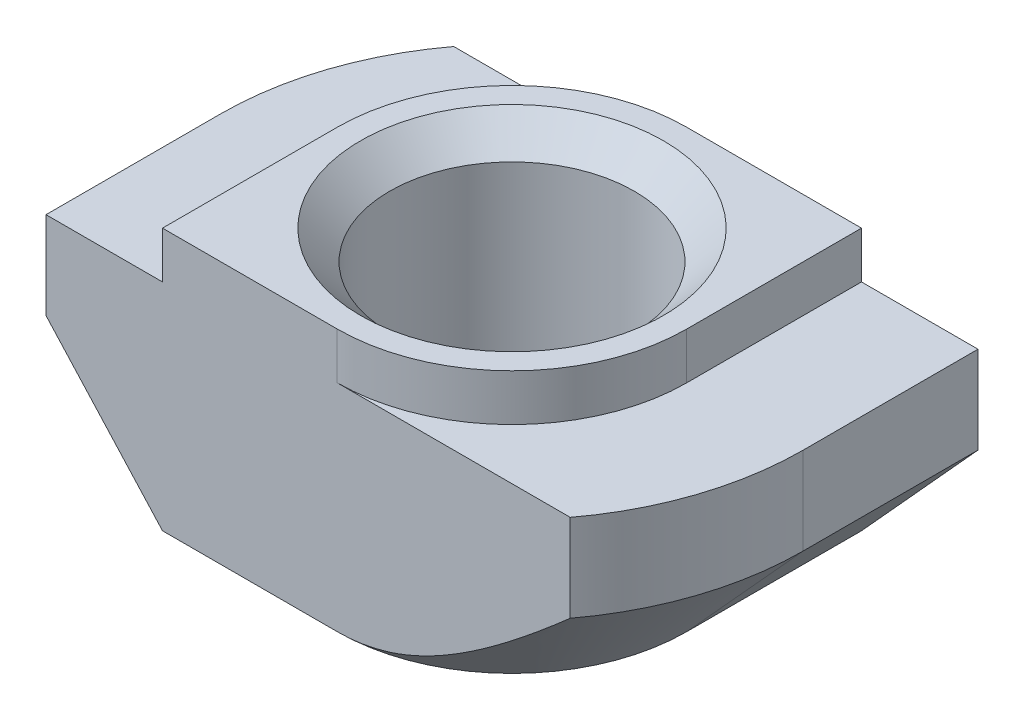
ISO-10303-21;
HEADER;
FILE_DESCRIPTION(('STEP AP214'),'2;1');
FILE_NAME('part.step','',(''),(''),'','','');
FILE_SCHEMA(('AUTOMOTIVE_DESIGN { 1 0 10303 214 1 1 1 1 }'));
ENDSEC;
DATA;
#1=APPLICATION_CONTEXT('core data for automotive mechanical design processes');
#2=APPLICATION_PROTOCOL_DEFINITION('international standard','automotive_design',2000,#1);
#3=PRODUCT_CONTEXT('',#1,'mechanical');
#4=PRODUCT('Part','Part','',(#3));
#5=PRODUCT_RELATED_PRODUCT_CATEGORY('part','',(#4));
#6=PRODUCT_DEFINITION_FORMATION('','',#4);
#7=PRODUCT_DEFINITION_CONTEXT('part definition',#1,'design');
#8=PRODUCT_DEFINITION('design','',#6,#7);
#9=PRODUCT_DEFINITION_SHAPE('','',#8);
#10=(LENGTH_UNIT() NAMED_UNIT(*) SI_UNIT(.MILLI.,.METRE.));
#11=(NAMED_UNIT(*) PLANE_ANGLE_UNIT() SI_UNIT($,.RADIAN.));
#12=(NAMED_UNIT(*) SI_UNIT($,.STERADIAN.) SOLID_ANGLE_UNIT());
#13=UNCERTAINTY_MEASURE_WITH_UNIT(LENGTH_MEASURE(1.E-05),#10,'distance_accuracy_value','');
#14=(GEOMETRIC_REPRESENTATION_CONTEXT(3) GLOBAL_UNCERTAINTY_ASSIGNED_CONTEXT((#13)) GLOBAL_UNIT_ASSIGNED_CONTEXT((#10,
#11,#12)) REPRESENTATION_CONTEXT('',''));
#15=CARTESIAN_POINT('',(0.,0.,0.));
#16=DIRECTION('',(0.,0.,1.));
#17=DIRECTION('',(1.,0.,0.));
#18=AXIS2_PLACEMENT_3D('',#15,#16,#17);
#19=CARTESIAN_POINT('',(-5.,-0.800000000000001,3.));
#20=DIRECTION('',(1.,0.,0.));
#21=DIRECTION('',(0.,0.,-1.));
#22=AXIS2_PLACEMENT_3D('',#19,#20,#21);
#23=PLANE('',#22);
#24=DIRECTION('',(0.,0.,-1.));
#25=VECTOR('',#24,1.);
#26=CARTESIAN_POINT('',(-5.,-2.3,3.));
#27=LINE('',#26,#25);
#28=CARTESIAN_POINT('',(-5.,-2.3,3.));
#29=VERTEX_POINT('',#28);
#30=CARTESIAN_POINT('',(-5.,-2.3,0.));
#31=VERTEX_POINT('',#30);
#32=EDGE_CURVE('E317',#29,#31,#27,.T.);
#33=ORIENTED_EDGE('',*,*,#32,.F.);
#34=DIRECTION('',(0.,-1.,0.));
#35=VECTOR('',#34,1.);
#36=CARTESIAN_POINT('',(-5.,-0.800000000000001,3.));
#37=LINE('',#36,#35);
#38=CARTESIAN_POINT('',(-5.,-0.800000000000001,3.));
#39=VERTEX_POINT('',#38);
#40=EDGE_CURVE('E163',#39,#29,#37,.T.);
#41=ORIENTED_EDGE('',*,*,#40,.F.);
#42=DIRECTION('',(0.,0.,-1.));
#43=VECTOR('',#42,1.);
#44=CARTESIAN_POINT('',(-5.,-0.800000000000001,3.));
#45=LINE('',#44,#43);
#46=CARTESIAN_POINT('',(-5.,-0.800000000000001,0.));
#47=VERTEX_POINT('',#46);
#48=EDGE_CURVE('E45',#39,#47,#45,.T.);
#49=ORIENTED_EDGE('',*,*,#48,.T.);
#50=DIRECTION('',(0.,1.,0.));
#51=VECTOR('',#50,1.);
#52=CARTESIAN_POINT('',(-5.,-4.5,0.));
#53=LINE('',#52,#51);
#54=EDGE_CURVE('E209',#31,#47,#53,.T.);
#55=ORIENTED_EDGE('',*,*,#54,.F.);
#56=EDGE_LOOP('',(#33,#41,#49,#55));
#57=FACE_BOUND('',#56,.T.);
#58=ADVANCED_FACE('F37',(#57),#23,.F.);
#59=CARTESIAN_POINT('',(-5.,-4.5,3.));
#60=DIRECTION('',(0.,1.,0.));
#61=DIRECTION('',(0.,0.,1.));
#62=AXIS2_PLACEMENT_3D('',#59,#60,#61);
#63=PLANE('',#62);
#64=CARTESIAN_POINT('',(0.,-4.5,0.));
#65=DIRECTION('',(0.,1.,0.));
#66=DIRECTION('',(0.,0.,1.));
#67=AXIS2_PLACEMENT_3D('',#64,#65,#66);
#68=CIRCLE('',#67,2.6);
#69=CARTESIAN_POINT('',(0.,-4.5,2.6));
#70=VERTEX_POINT('',#69);
#71=EDGE_CURVE('E258',#70,#70,#68,.T.);
#72=ORIENTED_EDGE('',*,*,#71,.T.);
#73=EDGE_LOOP('',(#72));
#74=FACE_BOUND('',#73,.T.);
#75=DIRECTION('',(1.,0.,0.));
#76=VECTOR('',#75,1.);
#77=CARTESIAN_POINT('',(-5.,-4.5,3.));
#78=LINE('',#77,#76);
#79=CARTESIAN_POINT('',(-3.,-4.5,3.));
#80=VERTEX_POINT('',#79);
#81=CARTESIAN_POINT('',(0.,-4.5,3.));
#82=VERTEX_POINT('',#81);
#83=EDGE_CURVE('E161',#80,#82,#78,.T.);
#84=ORIENTED_EDGE('',*,*,#83,.F.);
#85=DIRECTION('',(0.,0.,-1.));
#86=VECTOR('',#85,1.);
#87=CARTESIAN_POINT('',(-3.,-4.5,3.));
#88=LINE('',#87,#86);
#89=CARTESIAN_POINT('',(-3.,-4.5,0.));
#90=VERTEX_POINT('',#89);
#91=EDGE_CURVE('E146',#80,#90,#88,.T.);
#92=ORIENTED_EDGE('',*,*,#91,.T.);
#93=CARTESIAN_POINT('',(0.,-4.5,0.));
#94=DIRECTION('',(0.,-1.,0.));
#95=DIRECTION('',(-1.,0.,0.));
#96=AXIS2_PLACEMENT_3D('',#93,#94,#95);
#97=CIRCLE('',#96,2.99999999999998);
#98=CARTESIAN_POINT('',(0.,-4.5,-2.99999999999998));
#99=VERTEX_POINT('',#98);
#100=EDGE_CURVE('E318',#90,#99,#97,.T.);
#101=ORIENTED_EDGE('',*,*,#100,.T.);
#102=DIRECTION('',(1.,0.,0.));
#103=VECTOR('',#102,1.);
#104=CARTESIAN_POINT('',(-5.,-4.5,-3.));
#105=LINE('',#104,#103);
#106=CARTESIAN_POINT('',(3.,-4.5,-3.));
#107=VERTEX_POINT('',#106);
#108=EDGE_CURVE('E181',#99,#107,#105,.T.);
#109=ORIENTED_EDGE('',*,*,#108,.T.);
#110=DIRECTION('',(0.,0.,1.));
#111=VECTOR('',#110,1.);
#112=CARTESIAN_POINT('',(3.,-4.5,-5.));
#113=LINE('',#112,#111);
#114=CARTESIAN_POINT('',(3.,-4.5,0.));
#115=VERTEX_POINT('',#114);
#116=EDGE_CURVE('E52',#107,#115,#113,.T.);
#117=ORIENTED_EDGE('',*,*,#116,.T.);
#118=CARTESIAN_POINT('',(0.,-4.5,0.));
#119=DIRECTION('',(0.,-1.,0.));
#120=DIRECTION('',(1.,0.,0.));
#121=AXIS2_PLACEMENT_3D('',#118,#119,#120);
#122=CIRCLE('',#121,3.);
#123=EDGE_CURVE('E167',#115,#82,#122,.T.);
#124=ORIENTED_EDGE('',*,*,#123,.T.);
#125=EDGE_LOOP('',(#84,#92,#101,#109,#117,#124));
#126=FACE_BOUND('',#125,.T.);
#127=ADVANCED_FACE('F166',(#74,#126),#63,.F.);
#128=CARTESIAN_POINT('',(5.,-0.800000000000001,3.));
#129=DIRECTION('',(-1.,0.,0.));
#130=DIRECTION('',(0.,0.,1.));
#131=AXIS2_PLACEMENT_3D('',#128,#129,#130);
#132=PLANE('',#131);
#133=DIRECTION('',(0.,0.,1.));
#134=VECTOR('',#133,1.);
#135=CARTESIAN_POINT('',(5.,-2.3,-5.));
#136=LINE('',#135,#134);
#137=CARTESIAN_POINT('',(5.,-2.3,-3.));
#138=VERTEX_POINT('',#137);
#139=CARTESIAN_POINT('',(5.,-2.3,0.));
#140=VERTEX_POINT('',#139);
#141=EDGE_CURVE('E305',#138,#140,#136,.T.);
#142=ORIENTED_EDGE('',*,*,#141,.F.);
#143=DIRECTION('',(0.,1.,0.));
#144=VECTOR('',#143,1.);
#145=CARTESIAN_POINT('',(5.,-0.800000000000001,-3.));
#146=LINE('',#145,#144);
#147=CARTESIAN_POINT('',(5.,-0.800000000000001,-3.));
#148=VERTEX_POINT('',#147);
#149=EDGE_CURVE('E185',#138,#148,#146,.T.);
#150=ORIENTED_EDGE('',*,*,#149,.T.);
#151=DIRECTION('',(0.,0.,-1.));
#152=VECTOR('',#151,1.);
#153=CARTESIAN_POINT('',(5.,-0.800000000000001,3.));
#154=LINE('',#153,#152);
#155=CARTESIAN_POINT('',(5.,-0.799999999999999,0.));
#156=VERTEX_POINT('',#155);
#157=EDGE_CURVE('E203',#156,#148,#154,.T.);
#158=ORIENTED_EDGE('',*,*,#157,.F.);
#159=DIRECTION('',(0.,1.,0.));
#160=VECTOR('',#159,1.);
#161=CARTESIAN_POINT('',(5.,-4.5,0.));
#162=LINE('',#161,#160);
#163=EDGE_CURVE('E220',#140,#156,#162,.T.);
#164=ORIENTED_EDGE('',*,*,#163,.F.);
#165=EDGE_LOOP('',(#142,#150,#158,#164));
#166=FACE_BOUND('',#165,.T.);
#167=ADVANCED_FACE('F304',(#166),#132,.F.);
#168=CARTESIAN_POINT('',(0.,0.,3.));
#169=DIRECTION('',(0.,0.,-1.));
#170=DIRECTION('',(-1.,0.,0.));
#171=AXIS2_PLACEMENT_3D('',#168,#169,#170);
#172=PLANE('',#171);
#173=DIRECTION('',(-0.672672793996312,0.739940073395944,0.));
#174=VECTOR('',#173,1.);
#175=CARTESIAN_POINT('',(-3.,-4.5,3.));
#176=LINE('',#175,#174);
#177=EDGE_CURVE('E149',#80,#29,#176,.T.);
#178=ORIENTED_EDGE('',*,*,#177,.F.);
#179=ORIENTED_EDGE('',*,*,#83,.T.);
#180=CARTESIAN_POINT('',(8.56528488420533,2.18301393510955,3.));
#181=CARTESIAN_POINT('',(8.336042392276,1.94506172446586,3.));
#182=CARTESIAN_POINT('',(8.10631311159504,1.70757430920956,3.));
#183=CARTESIAN_POINT('',(7.64551409680837,1.23387312686237,3.));
#184=CARTESIAN_POINT('',(7.41444427373792,0.997659446357017,3.));
#185=CARTESIAN_POINT('',(6.95074727857469,0.527002922284947,3.));
#186=CARTESIAN_POINT('',(6.71812096870712,0.292559230318829,3.));
#187=CARTESIAN_POINT('',(6.25067088889651,-0.174118776187672,3.));
#188=CARTESIAN_POINT('',(6.01584718443249,-0.406353156148946,3.));
#189=CARTESIAN_POINT('',(5.62038955383489,-0.792436278152886,3.));
#190=CARTESIAN_POINT('',(5.4605691961006,-0.947117710041531,3.));
#191=CARTESIAN_POINT('',(5.13924211280618,-1.25471973911822,3.));
#192=CARTESIAN_POINT('',(4.97773540088465,-1.40764035052612,3.));
#193=CARTESIAN_POINT('',(4.65243717389983,-1.71134723849659,3.));
#194=CARTESIAN_POINT('',(4.48864364367823,-1.86213136124613,3.));
#195=CARTESIAN_POINT('',(4.15832129849217,-2.16066244382769,3.));
#196=CARTESIAN_POINT('',(3.99179267344124,-2.30840961294253,3.));
#197=CARTESIAN_POINT('',(3.67502933959276,-2.58253769216048,3.));
#198=CARTESIAN_POINT('',(3.52519519671427,-2.70937994437701,3.));
#199=CARTESIAN_POINT('',(3.22192221001868,-2.95867422998659,3.));
#200=CARTESIAN_POINT('',(3.06848376607595,-3.08112674662078,3.));
#201=CARTESIAN_POINT('',(2.75692799570068,-3.31985912877086,3.));
#202=CARTESIAN_POINT('',(2.59881223241667,-3.43614102099504,3.));
#203=CARTESIAN_POINT('',(2.27641686005113,-3.6597947081815,3.));
#204=CARTESIAN_POINT('',(2.1121408480234,-3.76717158878603,3.));
#205=CARTESIAN_POINT('',(1.85623649412789,-3.92021652847901,3.));
#206=CARTESIAN_POINT('',(1.7675565261946,-3.9707797472168,3.));
#207=CARTESIAN_POINT('',(1.58775783924168,-4.06731951755835,3.));
#208=CARTESIAN_POINT('',(1.49663894517337,-4.11329573881462,3.));
#209=CARTESIAN_POINT('',(1.21939259558399,-4.24256333018006,3.));
#210=CARTESIAN_POINT('',(1.02899510158821,-4.31743209180478,3.));
#211=CARTESIAN_POINT('',(0.755392260011176,-4.39800283607005,3.));
#212=CARTESIAN_POINT('',(0.676405488815064,-4.41825370574629,3.));
#213=CARTESIAN_POINT('',(0.517091283393969,-4.45243980770036,3.));
#214=CARTESIAN_POINT('',(0.436764560189595,-4.46637828552201,3.));
#215=CARTESIAN_POINT('',(0.275359895285572,-4.48729817004741,3.));
#216=CARTESIAN_POINT('',(0.194283722501903,-4.49429308094364,3.));
#217=CARTESIAN_POINT('',(0.0318264670063591,-4.50102204849326,3.));
#218=CARTESIAN_POINT('',(-0.0495546116377827,-4.5007562016696,3.));
#219=CARTESIAN_POINT('',(-0.211948053666092,-4.49297827159353,3.));
#220=CARTESIAN_POINT('',(-0.292960487989283,-4.48546764732863,3.));
#221=CARTESIAN_POINT('',(-0.454044201528726,-4.46357758160782,3.));
#222=CARTESIAN_POINT('',(-0.534115415562824,-4.44919766727235,3.));
#223=CARTESIAN_POINT('',(-0.693058117709121,-4.41417073117944,3.));
#224=CARTESIAN_POINT('',(-0.771926319049785,-4.39350896200337,3.));
#225=CARTESIAN_POINT('',(-0.927999706858947,-4.34671001550421,3.));
#226=CARTESIAN_POINT('',(-1.0052048597811,-4.320572727845,3.));
#227=CARTESIAN_POINT('',(-1.25592725377758,-4.22704979034008,3.));
#228=CARTESIAN_POINT('',(-1.42577516041485,-4.14980515635623,3.));
#229=CARTESIAN_POINT('',(-1.7571229896981,-3.97902915008715,3.));
#230=CARTESIAN_POINT('',(-1.91860569192747,-3.88546578765243,3.));
#231=CARTESIAN_POINT('',(-2.23613244034585,-3.68665550264099,3.));
#232=CARTESIAN_POINT('',(-2.39211515222633,-3.58131183983245,3.));
#233=CARTESIAN_POINT('',(-2.69855763508462,-3.36322232970804,3.));
#234=CARTESIAN_POINT('',(-2.84902171438153,-3.25048245691053,3.));
#235=CARTESIAN_POINT('',(-3.13482661197324,-3.02826682192062,3.));
#236=CARTESIAN_POINT('',(-3.27046224875265,-2.91916755772444,3.));
#237=CARTESIAN_POINT('',(-3.53896291037127,-2.6975660478194,3.));
#238=CARTESIAN_POINT('',(-3.67182732431156,-2.58506306490047,3.));
#239=CARTESIAN_POINT('',(-3.93243210144877,-2.35998699053387,3.));
#240=CARTESIAN_POINT('',(-4.06022090599257,-2.24746976299248,3.));
#241=CARTESIAN_POINT('',(-4.31399463935954,-2.02052874188546,3.));
#242=CARTESIAN_POINT('',(-4.43998034134838,-1.90610581397421,3.));
#243=CARTESIAN_POINT('',(-4.56528488420533,-1.79095602034035,3.));
#244=B_SPLINE_CURVE_WITH_KNOTS('',3,(#180,#181,#182,#183,#184,#185,#186,#187,#188,#189,#190,
#191,#192,#193,#194,#195,#196,#197,#198,#199,#200,#201,#202,#203,#204,#205,#206,#207,#208,#209,
#210,#211,#212,#213,#214,#215,#216,#217,#218,#219,#220,#221,#222,#223,#224,#225,#226,#227,#228,
#229,#230,#231,#232,#233,#234,#235,#236,#237,#238,#239,#240,#241,#242,#243),.UNSPECIFIED.,.F.,
.F.,(4,2,2,2,2,2,2,2,2,2,2,2,2,2,2,2,2,2,2,2,2,2,2,2,2,2,2,2,2,2,2,4),(0.,0.991245743739621,
1.98255804143403,2.9733604179706,3.96413336353297,4.63137143495993,5.29860411419179,
5.96646741219647,6.63428453099802,7.22316869295618,7.81198782766621,8.40061235546637,
8.98889837171226,9.29501429973074,9.60115225778937,10.2120870943495,10.4565075459561,
10.7008021846476,10.9446207706796,11.1884361154411,11.4322023697656,11.6759854072942,
11.9203452331532,12.164709983534,12.7229572376404,13.2823114015797,13.8466531824608,
14.410544581934,14.9326795174098,15.4549283631006,15.9657012579663,16.4762481441375),.UNSPECIFIED.);
#245=CARTESIAN_POINT('',(4.,-2.3,3.));
#246=VERTEX_POINT('',#245);
#247=EDGE_CURVE('E322',#246,#82,#244,.T.);
#248=ORIENTED_EDGE('',*,*,#247,.F.);
#249=DIRECTION('',(0.,1.,0.));
#250=VECTOR('',#249,1.);
#251=CARTESIAN_POINT('',(4.,-4.5,3.));
#252=LINE('',#251,#250);
#253=CARTESIAN_POINT('',(4.,-0.8,3.));
#254=VERTEX_POINT('',#253);
#255=EDGE_CURVE('E223',#246,#254,#252,.T.);
#256=ORIENTED_EDGE('',*,*,#255,.T.);
#257=DIRECTION('',(-1.,0.,0.));
#258=VECTOR('',#257,1.);
#259=CARTESIAN_POINT('',(3.,-0.8,3.));
#260=LINE('',#259,#258);
#261=CARTESIAN_POINT('',(0.,-0.8,3.));
#262=VERTEX_POINT('',#261);
#263=EDGE_CURVE('E168',#254,#262,#260,.T.);
#264=ORIENTED_EDGE('',*,*,#263,.T.);
#265=DIRECTION('',(0.,1.,0.));
#266=VECTOR('',#265,1.);
#267=CARTESIAN_POINT('',(0.,-5.04264068711929,3.));
#268=LINE('',#267,#266);
#269=CARTESIAN_POINT('',(0.,0.,3.));
#270=VERTEX_POINT('',#269);
#271=EDGE_CURVE('E246',#262,#270,#268,.T.);
#272=ORIENTED_EDGE('',*,*,#271,.T.);
#273=DIRECTION('',(-1.,0.,0.));
#274=VECTOR('',#273,1.);
#275=CARTESIAN_POINT('',(3.,0.,3.));
#276=LINE('',#275,#274);
#277=CARTESIAN_POINT('',(-3.,0.,3.));
#278=VERTEX_POINT('',#277);
#279=EDGE_CURVE('E170',#270,#278,#276,.T.);
#280=ORIENTED_EDGE('',*,*,#279,.T.);
#281=DIRECTION('',(0.,-1.,0.));
#282=VECTOR('',#281,1.);
#283=CARTESIAN_POINT('',(-3.,0.,3.));
#284=LINE('',#283,#282);
#285=CARTESIAN_POINT('',(-3.,-0.8,3.));
#286=VERTEX_POINT('',#285);
#287=EDGE_CURVE('E196',#278,#286,#284,.T.);
#288=ORIENTED_EDGE('',*,*,#287,.T.);
#289=DIRECTION('',(-1.,0.,0.));
#290=VECTOR('',#289,1.);
#291=CARTESIAN_POINT('',(-3.,-0.8,3.));
#292=LINE('',#291,#290);
#293=EDGE_CURVE('E172',#286,#39,#292,.T.);
#294=ORIENTED_EDGE('',*,*,#293,.T.);
#295=ORIENTED_EDGE('',*,*,#40,.T.);
#296=EDGE_LOOP('',(#178,#179,#248,#256,#264,#272,#280,#288,#294,#295));
#297=FACE_BOUND('',#296,.T.);
#298=ADVANCED_FACE('F159',(#297),#172,.F.);
#299=CARTESIAN_POINT('',(0.,0.,-3.));
#300=DIRECTION('',(0.,0.,-1.));
#301=DIRECTION('',(-1.,0.,0.));
#302=AXIS2_PLACEMENT_3D('',#299,#300,#301);
#303=PLANE('',#302);
#304=ORIENTED_EDGE('',*,*,#108,.F.);
#305=CARTESIAN_POINT('',(4.56528488420533,-1.79095602034032,-3.));
#306=CARTESIAN_POINT('',(4.42839885729641,-1.91673342260761,-3.));
#307=CARTESIAN_POINT('',(4.29070825629604,-2.04165708123198,-3.));
#308=CARTESIAN_POINT('',(4.01311022137334,-2.2891985262993,-3.));
#309=CARTESIAN_POINT('',(3.87320138847394,-2.41181474149276,-3.));
#310=CARTESIAN_POINT('',(3.5856246865415,-2.65835932361061,-3.));
#311=CARTESIAN_POINT('',(3.43785929429621,-2.78217447169403,-3.));
#312=CARTESIAN_POINT('',(3.13870555712778,-3.02527946804254,-3.));
#313=CARTESIAN_POINT('',(2.98731837973417,-3.14457074341603,-3.));
#314=CARTESIAN_POINT('',(2.67932755554925,-3.37720476464405,-3.));
#315=CARTESIAN_POINT('',(2.52271020820245,-3.49052949185593,-3.));
#316=CARTESIAN_POINT('',(2.20296452147528,-3.7081776430567,-3.));
#317=CARTESIAN_POINT('',(2.03982933047826,-3.81249120982559,-3.));
#318=CARTESIAN_POINT('',(1.79019758577874,-3.9578704108561,-3.));
#319=CARTESIAN_POINT('',(1.7067775126684,-4.00418975204737,-3.));
#320=CARTESIAN_POINT('',(1.53775147544231,-4.09263547313203,-3.));
#321=CARTESIAN_POINT('',(1.45214519070862,-4.13476123352878,-3.));
#322=CARTESIAN_POINT('',(1.19210931334085,-4.25323556698663,-3.));
#323=CARTESIAN_POINT('',(1.01395131317746,-4.32199210170041,-3.));
#324=CARTESIAN_POINT('',(0.745346751873809,-4.40089868793778,-3.));
#325=CARTESIAN_POINT('',(0.658318453040623,-4.42281603815454,-3.));
#326=CARTESIAN_POINT('',(0.482642298238637,-4.45891278284897,-3.));
#327=CARTESIAN_POINT('',(0.393994581761194,-4.47309284057409,-3.));
#328=CARTESIAN_POINT('',(0.216037909471066,-4.49288207496988,-3.));
#329=CARTESIAN_POINT('',(0.126732197427173,-4.49852003254059,-3.));
#330=CARTESIAN_POINT('',(-0.0520026715756645,-4.50096807462647,-3.));
#331=CARTESIAN_POINT('',(-0.141431827603297,-4.49777822538231,-3.));
#332=CARTESIAN_POINT('',(-0.319250763933687,-4.48279609283911,-3.));
#333=CARTESIAN_POINT('',(-0.407643026018313,-4.47103273201148,-3.));
#334=CARTESIAN_POINT('',(-0.583018344588809,-4.43960959822698,-3.));
#335=CARTESIAN_POINT('',(-0.670000952598425,-4.41994736165903,-3.));
#336=CARTESIAN_POINT('',(-0.842486782458988,-4.37358373680897,-3.));
#337=CARTESIAN_POINT('',(-0.9279810314998,-4.34684940618518,-3.));
#338=CARTESIAN_POINT('',(-1.0968573659184,-4.28745146556704,-3.));
#339=CARTESIAN_POINT('',(-1.18023946905554,-4.25478790544571,-3.));
#340=CARTESIAN_POINT('',(-1.36570253725023,-4.17565465593902,-3.));
#341=CARTESIAN_POINT('',(-1.46718157138529,-4.12778226156665,-3.));
#342=CARTESIAN_POINT('',(-1.66707298699795,-4.02597724576113,-3.));
#343=CARTESIAN_POINT('',(-1.76548385637139,-3.97204169465492,-3.));
#344=CARTESIAN_POINT('',(-1.95973278437517,-3.85933814531602,-3.));
#345=CARTESIAN_POINT('',(-2.05556549824463,-3.80056100153299,-3.));
#346=CARTESIAN_POINT('',(-2.24481227463867,-3.6792892907557,-3.));
#347=CARTESIAN_POINT('',(-2.33822672015715,-3.61679531764913,-3.));
#348=CARTESIAN_POINT('',(-2.52405927711159,-3.48811153305375,-3.));
#349=CARTESIAN_POINT('',(-2.61645357258282,-3.42188748133433,-3.));
#350=CARTESIAN_POINT('',(-2.79944858607247,-3.28700935921293,-3.));
#351=CARTESIAN_POINT('',(-2.89004925164131,-3.21835521791309,-3.));
#352=CARTESIAN_POINT('',(-3.06961311011181,-3.07915767893173,-3.));
#353=CARTESIAN_POINT('',(-3.15857809973083,-3.00861659270619,-3.));
#354=CARTESIAN_POINT('',(-3.33519795578114,-2.86591970498384,-3.));
#355=CARTESIAN_POINT('',(-3.4228528435281,-2.79376392980623,-3.));
#356=CARTESIAN_POINT('',(-3.62621162727783,-2.62372045812024,-3.));
#357=CARTESIAN_POINT('',(-3.74147696764729,-2.52530870473998,-3.));
#358=CARTESIAN_POINT('',(-3.97036354639596,-2.32658886836678,-3.));
#359=CARTESIAN_POINT('',(-4.08398472073968,-2.2262807118635,-3.));
#360=CARTESIAN_POINT('',(-4.42284189926169,-1.92305836675397,-3.));
#361=CARTESIAN_POINT('',(-4.64604269620312,-1.71787076794243,-3.));
#362=CARTESIAN_POINT('',(-5.08885043587136,-1.30320023106152,-3.));
#363=CARTESIAN_POINT('',(-5.30845317819351,-1.09371283796563,-3.));
#364=CARTESIAN_POINT('',(-5.74484899551352,-0.671825061357189,-3.));
#365=CARTESIAN_POINT('',(-5.96164199489613,-0.459424599763989,-3.));
#366=CARTESIAN_POINT('',(-6.37936652531521,-0.0460880905598762,-3.));
#367=CARTESIAN_POINT('',(-6.58042866504368,0.154716268202102,-3.));
#368=CARTESIAN_POINT('',(-6.98110372806068,0.557774180103405,-3.));
#369=CARTESIAN_POINT('',(-7.18071661572182,0.760027768628347,-3.));
#370=CARTESIAN_POINT('',(-7.5783559544936,1.16522743736274,-3.));
#371=CARTESIAN_POINT('',(-7.77638490659006,1.36817106601214,-3.));
#372=CARTESIAN_POINT('',(-8.17149294521518,1.77496414757543,-3.));
#373=CARTESIAN_POINT('',(-8.36857207240979,1.97881356097766,-3.));
#374=CARTESIAN_POINT('',(-8.56528488420533,2.18301393510958,-3.));
#375=B_SPLINE_CURVE_WITH_KNOTS('',3,(#305,#306,#307,#308,#309,#310,#311,#312,#313,#314,#315,
#316,#317,#318,#319,#320,#321,#322,#323,#324,#325,#326,#327,#328,#329,#330,#331,#332,#333,#334,
#335,#336,#337,#338,#339,#340,#341,#342,#343,#344,#345,#346,#347,#348,#349,#350,#351,#352,#353,
#354,#355,#356,#357,#358,#359,#360,#361,#362,#363,#364,#365,#366,#367,#368,#369,#370,#371,#372,
#373,#374),.UNSPECIFIED.,.F.,.F.,(4,2,2,2,2,2,2,2,2,2,2,2,2,2,2,2,2,2,2,2,2,2,2,2,2,2,2,2,2,2,2,
2,2,2,4),(0.,0.557709889033308,1.11578672818032,1.69406871798971,2.27216673821034,
2.85192074217125,3.43230110810091,3.71843822555145,4.00461755007192,4.57518829810499,
4.84414410060724,5.11307684436059,5.38110144203277,5.64912402855096,5.91624660987452,
6.18345256986256,6.45192580847491,6.72039678896069,7.05673990097462,7.39324623580336,
7.73040347109618,8.0675069782348,8.40848761114185,8.74947820037108,9.0900686587882,
9.43065356966887,9.88531114864963,10.3399863878215,11.2494503335336,12.1599095877827,
13.0703932934704,13.922872369386,14.775372331565,15.6260242906098,16.4766395002808),.UNSPECIFIED.);
#376=CARTESIAN_POINT('',(-4.,-2.29999999999998,-3.));
#377=VERTEX_POINT('',#376);
#378=EDGE_CURVE('E227',#99,#377,#375,.T.);
#379=ORIENTED_EDGE('',*,*,#378,.T.);
#380=DIRECTION('',(0.,1.,0.));
#381=VECTOR('',#380,1.);
#382=CARTESIAN_POINT('',(-4.,-4.5,-3.));
#383=LINE('',#382,#381);
#384=CARTESIAN_POINT('',(-4.,-0.8,-3.));
#385=VERTEX_POINT('',#384);
#386=EDGE_CURVE('E219',#377,#385,#383,.T.);
#387=ORIENTED_EDGE('',*,*,#386,.T.);
#388=DIRECTION('',(-1.,0.,0.));
#389=VECTOR('',#388,1.);
#390=CARTESIAN_POINT('',(-3.,-0.8,-3.));
#391=LINE('',#390,#389);
#392=CARTESIAN_POINT('',(0.,-0.8,-3.));
#393=VERTEX_POINT('',#392);
#394=EDGE_CURVE('E178',#393,#385,#391,.T.);
#395=ORIENTED_EDGE('',*,*,#394,.F.);
#396=DIRECTION('',(0.,1.,0.));
#397=VECTOR('',#396,1.);
#398=CARTESIAN_POINT('',(0.,-5.04264068711929,-3.));
#399=LINE('',#398,#397);
#400=CARTESIAN_POINT('',(0.,0.,-3.));
#401=VERTEX_POINT('',#400);
#402=EDGE_CURVE('E255',#393,#401,#399,.T.);
#403=ORIENTED_EDGE('',*,*,#402,.T.);
#404=DIRECTION('',(-1.,0.,0.));
#405=VECTOR('',#404,1.);
#406=CARTESIAN_POINT('',(3.,0.,-3.));
#407=LINE('',#406,#405);
#408=CARTESIAN_POINT('',(3.,0.,-3.));
#409=VERTEX_POINT('',#408);
#410=EDGE_CURVE('E193',#409,#401,#407,.T.);
#411=ORIENTED_EDGE('',*,*,#410,.F.);
#412=DIRECTION('',(0.,1.,0.));
#413=VECTOR('',#412,1.);
#414=CARTESIAN_POINT('',(3.,0.,-3.));
#415=LINE('',#414,#413);
#416=CARTESIAN_POINT('',(3.,-0.8,-3.));
#417=VERTEX_POINT('',#416);
#418=EDGE_CURVE('E190',#417,#409,#415,.T.);
#419=ORIENTED_EDGE('',*,*,#418,.F.);
#420=DIRECTION('',(-1.,0.,0.));
#421=VECTOR('',#420,1.);
#422=CARTESIAN_POINT('',(3.,-0.8,-3.));
#423=LINE('',#422,#421);
#424=EDGE_CURVE('E187',#148,#417,#423,.T.);
#425=ORIENTED_EDGE('',*,*,#424,.F.);
#426=ORIENTED_EDGE('',*,*,#149,.F.);
#427=DIRECTION('',(-0.672672793996313,-0.739940073395944,0.));
#428=VECTOR('',#427,1.);
#429=CARTESIAN_POINT('',(3.88235294117647,-3.52941176470588,-3.));
#430=LINE('',#429,#428);
#431=EDGE_CURVE('E314',#138,#107,#430,.T.);
#432=ORIENTED_EDGE('',*,*,#431,.T.);
#433=EDGE_LOOP('',(#304,#379,#387,#395,#403,#411,#419,#425,#426,#432));
#434=FACE_BOUND('',#433,.T.);
#435=ADVANCED_FACE('F283',(#434),#303,.T.);
#436=CARTESIAN_POINT('',(0.,-4.5,0.));
#437=DIRECTION('',(0.,1.,0.));
#438=DIRECTION('',(-1.,0.,0.));
#439=AXIS2_PLACEMENT_3D('',#436,#437,#438);
#440=CYLINDRICAL_SURFACE('',#439,5.);
#441=CARTESIAN_POINT('',(0.,-2.3,0.));
#442=DIRECTION('',(0.,-1.,0.));
#443=DIRECTION('',(-1.,0.,0.));
#444=AXIS2_PLACEMENT_3D('',#441,#442,#443);
#445=CIRCLE('',#444,4.99999999999998);
#446=EDGE_CURVE('E60',#31,#377,#445,.T.);
#447=ORIENTED_EDGE('',*,*,#446,.F.);
#448=ORIENTED_EDGE('',*,*,#54,.T.);
#449=CARTESIAN_POINT('',(0.,-0.8,0.));
#450=DIRECTION('',(0.,-1.,0.));
#451=DIRECTION('',(-1.,0.,0.));
#452=AXIS2_PLACEMENT_3D('',#449,#450,#451);
#453=CIRCLE('',#452,5.);
#454=EDGE_CURVE('E215',#47,#385,#453,.T.);
#455=ORIENTED_EDGE('',*,*,#454,.T.);
#456=ORIENTED_EDGE('',*,*,#386,.F.);
#457=EDGE_LOOP('',(#447,#448,#455,#456));
#458=FACE_BOUND('',#457,.T.);
#459=ADVANCED_FACE('F345',(#458),#440,.T.);
#460=CARTESIAN_POINT('',(0.,-4.5,0.));
#461=DIRECTION('',(0.,1.,0.));
#462=DIRECTION('',(-1.,0.,0.));
#463=AXIS2_PLACEMENT_3D('',#460,#461,#462);
#464=CYLINDRICAL_SURFACE('',#463,5.);
#465=CARTESIAN_POINT('',(0.,-2.3,0.));
#466=DIRECTION('',(0.,-1.,0.));
#467=DIRECTION('',(1.,0.,0.));
#468=AXIS2_PLACEMENT_3D('',#465,#466,#467);
#469=CIRCLE('',#468,5.);
#470=EDGE_CURVE('E310',#140,#246,#469,.T.);
#471=ORIENTED_EDGE('',*,*,#470,.F.);
#472=ORIENTED_EDGE('',*,*,#163,.T.);
#473=CARTESIAN_POINT('',(0.,-0.8,0.));
#474=DIRECTION('',(0.,-1.,0.));
#475=DIRECTION('',(1.,0.,0.));
#476=AXIS2_PLACEMENT_3D('',#473,#474,#475);
#477=CIRCLE('',#476,5.);
#478=EDGE_CURVE('E237',#156,#254,#477,.T.);
#479=ORIENTED_EDGE('',*,*,#478,.T.);
#480=ORIENTED_EDGE('',*,*,#255,.F.);
#481=EDGE_LOOP('',(#471,#472,#479,#480));
#482=FACE_BOUND('',#481,.T.);
#483=ADVANCED_FACE('F348',(#482),#464,.T.);
#484=CARTESIAN_POINT('',(3.,0.,3.));
#485=DIRECTION('',(0.,-1.,0.));
#486=DIRECTION('',(0.,0.,-1.));
#487=AXIS2_PLACEMENT_3D('',#484,#485,#486);
#488=PLANE('',#487);
#489=ORIENTED_EDGE('',*,*,#279,.F.);
#490=CARTESIAN_POINT('',(0.,0.,0.));
#491=DIRECTION('',(0.,-1.,0.));
#492=DIRECTION('',(0.,0.,-1.));
#493=AXIS2_PLACEMENT_3D('',#490,#491,#492);
#494=CIRCLE('',#493,3.);
#495=CARTESIAN_POINT('',(3.,0.,0.));
#496=VERTEX_POINT('',#495);
#497=EDGE_CURVE('E235',#496,#270,#494,.T.);
#498=ORIENTED_EDGE('',*,*,#497,.F.);
#499=DIRECTION('',(0.,0.,-1.));
#500=VECTOR('',#499,1.);
#501=CARTESIAN_POINT('',(3.,0.,3.));
#502=LINE('',#501,#500);
#503=EDGE_CURVE('E199',#496,#409,#502,.T.);
#504=ORIENTED_EDGE('',*,*,#503,.T.);
#505=ORIENTED_EDGE('',*,*,#410,.T.);
#506=CARTESIAN_POINT('',(0.,0.,0.));
#507=DIRECTION('',(0.,-1.,0.));
#508=DIRECTION('',(0.,0.,-1.));
#509=AXIS2_PLACEMENT_3D('',#506,#507,#508);
#510=CIRCLE('',#509,3.);
#511=CARTESIAN_POINT('',(-3.,0.,0.));
#512=VERTEX_POINT('',#511);
#513=EDGE_CURVE('E250',#512,#401,#510,.T.);
#514=ORIENTED_EDGE('',*,*,#513,.F.);
#515=DIRECTION('',(0.,0.,-1.));
#516=VECTOR('',#515,1.);
#517=CARTESIAN_POINT('',(-3.,0.,3.));
#518=LINE('',#517,#516);
#519=EDGE_CURVE('E177',#278,#512,#518,.T.);
#520=ORIENTED_EDGE('',*,*,#519,.F.);
#521=EDGE_LOOP('',(#489,#498,#504,#505,#514,#520));
#522=FACE_BOUND('',#521,.T.);
#523=CARTESIAN_POINT('',(0.,0.,0.));
#524=DIRECTION('',(0.,1.,0.));
#525=DIRECTION('',(0.,0.,1.));
#526=AXIS2_PLACEMENT_3D('',#523,#524,#525);
#527=CIRCLE('',#526,2.6);
#528=CARTESIAN_POINT('',(0.,0.,2.6));
#529=VERTEX_POINT('',#528);
#530=EDGE_CURVE('E262',#529,#529,#527,.T.);
#531=ORIENTED_EDGE('',*,*,#530,.F.);
#532=EDGE_LOOP('',(#531));
#533=FACE_BOUND('',#532,.T.);
#534=ADVANCED_FACE('F286',(#522,#533),#488,.F.);
#535=CARTESIAN_POINT('',(-3.,0.,3.));
#536=DIRECTION('',(1.,0.,0.));
#537=DIRECTION('',(0.,0.,-1.));
#538=AXIS2_PLACEMENT_3D('',#535,#536,#537);
#539=PLANE('',#538);
#540=ORIENTED_EDGE('',*,*,#519,.T.);
#541=DIRECTION('',(0.,1.,0.));
#542=VECTOR('',#541,1.);
#543=CARTESIAN_POINT('',(-3.,-5.04264068711929,0.));
#544=LINE('',#543,#542);
#545=CARTESIAN_POINT('',(-3.,-0.8,0.));
#546=VERTEX_POINT('',#545);
#547=EDGE_CURVE('E252',#546,#512,#544,.T.);
#548=ORIENTED_EDGE('',*,*,#547,.F.);
#549=DIRECTION('',(0.,0.,-1.));
#550=VECTOR('',#549,1.);
#551=CARTESIAN_POINT('',(-3.,-0.8,3.));
#552=LINE('',#551,#550);
#553=EDGE_CURVE('E11',#286,#546,#552,.T.);
#554=ORIENTED_EDGE('',*,*,#553,.F.);
#555=ORIENTED_EDGE('',*,*,#287,.F.);
#556=EDGE_LOOP('',(#540,#548,#554,#555));
#557=FACE_BOUND('',#556,.T.);
#558=ADVANCED_FACE('F39',(#557),#539,.F.);
#559=CARTESIAN_POINT('',(-3.,-0.8,3.));
#560=DIRECTION('',(0.,-1.,0.));
#561=DIRECTION('',(1.,0.,0.));
#562=AXIS2_PLACEMENT_3D('',#559,#560,#561);
#563=PLANE('',#562);
#564=ORIENTED_EDGE('',*,*,#394,.T.);
#565=ORIENTED_EDGE('',*,*,#454,.F.);
#566=ORIENTED_EDGE('',*,*,#48,.F.);
#567=ORIENTED_EDGE('',*,*,#293,.F.);
#568=ORIENTED_EDGE('',*,*,#553,.T.);
#569=CARTESIAN_POINT('',(0.,-0.8,0.));
#570=DIRECTION('',(0.,-1.,0.));
#571=DIRECTION('',(1.,0.,0.));
#572=AXIS2_PLACEMENT_3D('',#569,#570,#571);
#573=CIRCLE('',#572,3.);
#574=EDGE_CURVE('E253',#546,#393,#573,.T.);
#575=ORIENTED_EDGE('',*,*,#574,.T.);
#576=EDGE_LOOP('',(#564,#565,#566,#567,#568,#575));
#577=FACE_BOUND('',#576,.T.);
#578=ADVANCED_FACE('F212',(#577),#563,.F.);
#579=CARTESIAN_POINT('',(3.,-0.8,3.));
#580=DIRECTION('',(0.,-1.,0.));
#581=DIRECTION('',(1.,0.,0.));
#582=AXIS2_PLACEMENT_3D('',#579,#580,#581);
#583=PLANE('',#582);
#584=ORIENTED_EDGE('',*,*,#263,.F.);
#585=ORIENTED_EDGE('',*,*,#478,.F.);
#586=ORIENTED_EDGE('',*,*,#157,.T.);
#587=ORIENTED_EDGE('',*,*,#424,.T.);
#588=DIRECTION('',(0.,0.,-1.));
#589=VECTOR('',#588,1.);
#590=CARTESIAN_POINT('',(3.,-0.8,3.));
#591=LINE('',#590,#589);
#592=CARTESIAN_POINT('',(3.,-0.799999999999999,0.));
#593=VERTEX_POINT('',#592);
#594=EDGE_CURVE('E201',#593,#417,#591,.T.);
#595=ORIENTED_EDGE('',*,*,#594,.F.);
#596=CARTESIAN_POINT('',(0.,-0.8,0.));
#597=DIRECTION('',(0.,-1.,0.));
#598=DIRECTION('',(1.,0.,0.));
#599=AXIS2_PLACEMENT_3D('',#596,#597,#598);
#600=CIRCLE('',#599,3.);
#601=EDGE_CURVE('E243',#593,#262,#600,.T.);
#602=ORIENTED_EDGE('',*,*,#601,.T.);
#603=EDGE_LOOP('',(#584,#585,#586,#587,#595,#602));
#604=FACE_BOUND('',#603,.T.);
#605=ADVANCED_FACE('F298',(#604),#583,.F.);
#606=CARTESIAN_POINT('',(3.,0.,3.));
#607=DIRECTION('',(-1.,0.,0.));
#608=DIRECTION('',(0.,0.,1.));
#609=AXIS2_PLACEMENT_3D('',#606,#607,#608);
#610=PLANE('',#609);
#611=ORIENTED_EDGE('',*,*,#503,.F.);
#612=DIRECTION('',(0.,1.,0.));
#613=VECTOR('',#612,1.);
#614=CARTESIAN_POINT('',(3.,-5.04264068711929,0.));
#615=LINE('',#614,#613);
#616=EDGE_CURVE('E242',#593,#496,#615,.T.);
#617=ORIENTED_EDGE('',*,*,#616,.F.);
#618=ORIENTED_EDGE('',*,*,#594,.T.);
#619=ORIENTED_EDGE('',*,*,#418,.T.);
#620=EDGE_LOOP('',(#611,#617,#618,#619));
#621=FACE_BOUND('',#620,.T.);
#622=ADVANCED_FACE('F292',(#621),#610,.F.);
#623=CARTESIAN_POINT('',(0.,-4.,0.));
#624=DIRECTION('',(0.,-1.,0.));
#625=DIRECTION('',(0.,0.,-1.));
#626=AXIS2_PLACEMENT_3D('',#623,#624,#625);
#627=CONICAL_SURFACE('',#626,2.1,0.785398163397447);
#628=ORIENTED_EDGE('',*,*,#71,.F.);
#629=EDGE_LOOP('',(#628));
#630=FACE_BOUND('',#629,.T.);
#631=CARTESIAN_POINT('',(0.,-4.,0.));
#632=DIRECTION('',(0.,1.,0.));
#633=DIRECTION('',(0.,0.,1.));
#634=AXIS2_PLACEMENT_3D('',#631,#632,#633);
#635=CIRCLE('',#634,2.1);
#636=CARTESIAN_POINT('',(0.,-4.,2.1));
#637=VERTEX_POINT('',#636);
#638=EDGE_CURVE('E182',#637,#637,#635,.T.);
#639=ORIENTED_EDGE('',*,*,#638,.T.);
#640=EDGE_LOOP('',(#639));
#641=FACE_BOUND('',#640,.T.);
#642=ADVANCED_FACE('F363',(#630,#641),#627,.F.);
#643=CARTESIAN_POINT('',(0.,0.,0.));
#644=DIRECTION('',(0.,1.,0.));
#645=DIRECTION('',(0.,0.,1.));
#646=AXIS2_PLACEMENT_3D('',#643,#644,#645);
#647=CYLINDRICAL_SURFACE('',#646,2.1);
#648=ORIENTED_EDGE('',*,*,#638,.F.);
#649=EDGE_LOOP('',(#648));
#650=FACE_BOUND('',#649,.T.);
#651=CARTESIAN_POINT('',(0.,-0.5,0.));
#652=DIRECTION('',(0.,1.,0.));
#653=DIRECTION('',(0.,0.,1.));
#654=AXIS2_PLACEMENT_3D('',#651,#652,#653);
#655=CIRCLE('',#654,2.1);
#656=CARTESIAN_POINT('',(0.,-0.5,2.1));
#657=VERTEX_POINT('',#656);
#658=EDGE_CURVE('E265',#657,#657,#655,.T.);
#659=ORIENTED_EDGE('',*,*,#658,.T.);
#660=EDGE_LOOP('',(#659));
#661=FACE_BOUND('',#660,.T.);
#662=ADVANCED_FACE('F360',(#650,#661),#647,.F.);
#663=CARTESIAN_POINT('',(0.,0.,0.));
#664=DIRECTION('',(0.,1.,0.));
#665=DIRECTION('',(0.,0.,1.));
#666=AXIS2_PLACEMENT_3D('',#663,#664,#665);
#667=CONICAL_SURFACE('',#666,2.6,0.785398163397449);
#668=ORIENTED_EDGE('',*,*,#658,.F.);
#669=EDGE_LOOP('',(#668));
#670=FACE_BOUND('',#669,.T.);
#671=ORIENTED_EDGE('',*,*,#530,.T.);
#672=EDGE_LOOP('',(#671));
#673=FACE_BOUND('',#672,.T.);
#674=ADVANCED_FACE('F357',(#670,#673),#667,.F.);
#675=CARTESIAN_POINT('',(0.,-5.04264068711929,0.));
#676=DIRECTION('',(0.,1.,0.));
#677=DIRECTION('',(0.,0.,1.));
#678=AXIS2_PLACEMENT_3D('',#675,#676,#677);
#679=CYLINDRICAL_SURFACE('',#678,3.);
#680=ORIENTED_EDGE('',*,*,#547,.T.);
#681=ORIENTED_EDGE('',*,*,#513,.T.);
#682=ORIENTED_EDGE('',*,*,#402,.F.);
#683=ORIENTED_EDGE('',*,*,#574,.F.);
#684=EDGE_LOOP('',(#680,#681,#682,#683));
#685=FACE_BOUND('',#684,.T.);
#686=ADVANCED_FACE('F278',(#685),#679,.T.);
#687=CARTESIAN_POINT('',(0.,-5.04264068711929,0.));
#688=DIRECTION('',(0.,1.,0.));
#689=DIRECTION('',(0.,0.,1.));
#690=AXIS2_PLACEMENT_3D('',#687,#688,#689);
#691=CYLINDRICAL_SURFACE('',#690,3.);
#692=ORIENTED_EDGE('',*,*,#616,.T.);
#693=ORIENTED_EDGE('',*,*,#497,.T.);
#694=ORIENTED_EDGE('',*,*,#271,.F.);
#695=ORIENTED_EDGE('',*,*,#601,.F.);
#696=EDGE_LOOP('',(#692,#693,#694,#695));
#697=FACE_BOUND('',#696,.T.);
#698=ADVANCED_FACE('F340',(#697),#691,.T.);
#699=CARTESIAN_POINT('',(3.,-4.5,-5.));
#700=DIRECTION('',(0.739940073395944,-0.672672793996312,0.));
#701=DIRECTION('',(0.672672793996313,0.739940073395944,0.));
#702=AXIS2_PLACEMENT_3D('',#699,#700,#701);
#703=PLANE('',#702);
#704=ORIENTED_EDGE('',*,*,#141,.T.);
#705=DIRECTION('',(0.672672793996312,0.739940073395944,0.));
#706=VECTOR('',#705,1.);
#707=CARTESIAN_POINT('',(3.,-4.5,0.));
#708=LINE('',#707,#706);
#709=EDGE_CURVE('E307',#115,#140,#708,.T.);
#710=ORIENTED_EDGE('',*,*,#709,.F.);
#711=ORIENTED_EDGE('',*,*,#116,.F.);
#712=ORIENTED_EDGE('',*,*,#431,.F.);
#713=EDGE_LOOP('',(#704,#710,#711,#712));
#714=FACE_BOUND('',#713,.T.);
#715=ADVANCED_FACE('F335',(#714),#703,.T.);
#716=CARTESIAN_POINT('',(0.,-4.5,0.));
#717=DIRECTION('',(0.,1.,0.));
#718=DIRECTION('',(0.,0.,1.));
#719=AXIS2_PLACEMENT_3D('',#716,#717,#718);
#720=CONICAL_SURFACE('',#719,3.,0.737815060120465);
#721=ORIENTED_EDGE('',*,*,#247,.T.);
#722=ORIENTED_EDGE('',*,*,#123,.F.);
#723=ORIENTED_EDGE('',*,*,#709,.T.);
#724=ORIENTED_EDGE('',*,*,#470,.T.);
#725=EDGE_LOOP('',(#721,#722,#723,#724));
#726=FACE_BOUND('',#725,.T.);
#727=ADVANCED_FACE('F331',(#726),#720,.T.);
#728=CARTESIAN_POINT('',(-3.,-4.5,3.));
#729=DIRECTION('',(-0.739940073395944,-0.672672793996312,0.));
#730=DIRECTION('',(0.672672793996313,-0.739940073395944,0.));
#731=AXIS2_PLACEMENT_3D('',#728,#729,#730);
#732=PLANE('',#731);
#733=ORIENTED_EDGE('',*,*,#32,.T.);
#734=DIRECTION('',(-0.672672793996312,0.739940073395944,0.));
#735=VECTOR('',#734,1.);
#736=CARTESIAN_POINT('',(-3.,-4.5,0.));
#737=LINE('',#736,#735);
#738=EDGE_CURVE('E151',#90,#31,#737,.T.);
#739=ORIENTED_EDGE('',*,*,#738,.F.);
#740=ORIENTED_EDGE('',*,*,#91,.F.);
#741=ORIENTED_EDGE('',*,*,#177,.T.);
#742=EDGE_LOOP('',(#733,#739,#740,#741));
#743=FACE_BOUND('',#742,.T.);
#744=ADVANCED_FACE('F148',(#743),#732,.T.);
#745=CARTESIAN_POINT('',(0.,-4.5,0.));
#746=DIRECTION('',(0.,1.,0.));
#747=DIRECTION('',(0.,0.,1.));
#748=AXIS2_PLACEMENT_3D('',#745,#746,#747);
#749=CONICAL_SURFACE('',#748,2.99999999999998,0.737815060120465);
#750=ORIENTED_EDGE('',*,*,#100,.F.);
#751=ORIENTED_EDGE('',*,*,#738,.T.);
#752=ORIENTED_EDGE('',*,*,#446,.T.);
#753=ORIENTED_EDGE('',*,*,#378,.F.);
#754=EDGE_LOOP('',(#750,#751,#752,#753));
#755=FACE_BOUND('',#754,.T.);
#756=ADVANCED_FACE('F337',(#755),#749,.T.);
#757=CLOSED_SHELL('',(#58,#127,#167,#298,#435,#459,#483,#534,#558,#578,#605,#622,#642,#662,#674,
#686,#698,#715,#727,#744,#756));
#758=MANIFOLD_SOLID_BREP('B2',#757);
#759=ADVANCED_BREP_SHAPE_REPRESENTATION('',(#18,#758),#14);
#760=SHAPE_DEFINITION_REPRESENTATION(#9,#759);
ENDSEC;
END-ISO-10303-21;
